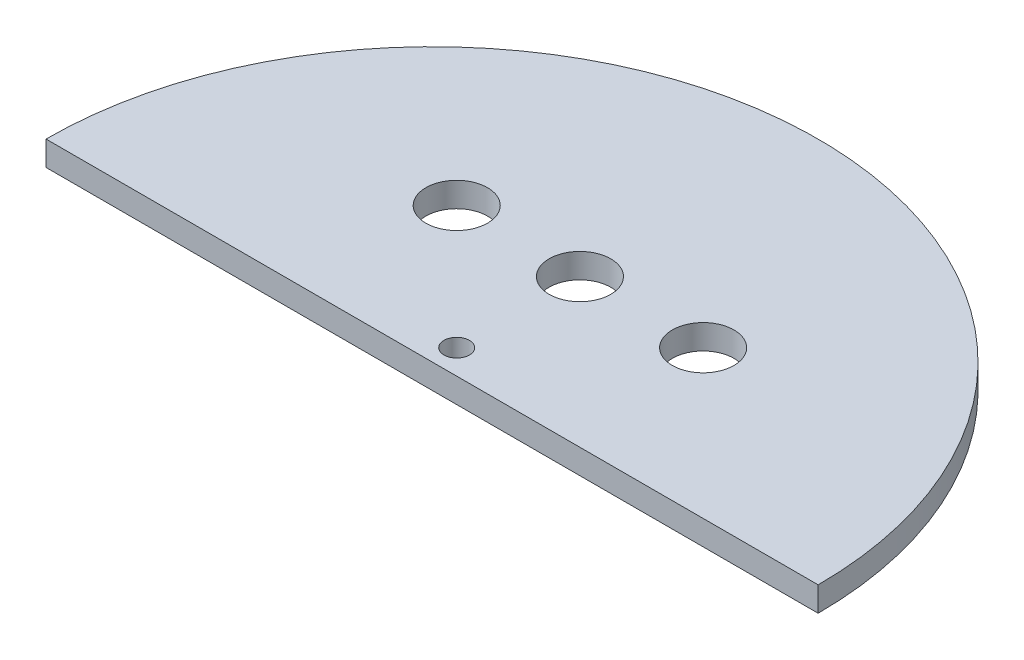
ISO-10303-21;
HEADER;
FILE_DESCRIPTION(('STEP AP214'),'2;1');
FILE_NAME('part.step','',(''),(''),'','','');
FILE_SCHEMA(('AUTOMOTIVE_DESIGN { 1 0 10303 214 1 1 1 1 }'));
ENDSEC;
DATA;
#1=APPLICATION_CONTEXT('core data for automotive mechanical design processes');
#2=APPLICATION_PROTOCOL_DEFINITION('international standard','automotive_design',2000,#1);
#3=PRODUCT_CONTEXT('',#1,'mechanical');
#4=PRODUCT('Part','Part','',(#3));
#5=PRODUCT_RELATED_PRODUCT_CATEGORY('part','',(#4));
#6=PRODUCT_DEFINITION_FORMATION('','',#4);
#7=PRODUCT_DEFINITION_CONTEXT('part definition',#1,'design');
#8=PRODUCT_DEFINITION('design','',#6,#7);
#9=PRODUCT_DEFINITION_SHAPE('','',#8);
#10=(LENGTH_UNIT() NAMED_UNIT(*) SI_UNIT(.MILLI.,.METRE.));
#11=(NAMED_UNIT(*) PLANE_ANGLE_UNIT() SI_UNIT($,.RADIAN.));
#12=(NAMED_UNIT(*) SI_UNIT($,.STERADIAN.) SOLID_ANGLE_UNIT());
#13=UNCERTAINTY_MEASURE_WITH_UNIT(LENGTH_MEASURE(1.E-05),#10,'distance_accuracy_value','');
#14=(GEOMETRIC_REPRESENTATION_CONTEXT(3) GLOBAL_UNCERTAINTY_ASSIGNED_CONTEXT((#13)) GLOBAL_UNIT_ASSIGNED_CONTEXT((#10,
#11,#12)) REPRESENTATION_CONTEXT('',''));
#15=CARTESIAN_POINT('',(0.,0.,0.));
#16=DIRECTION('',(0.,0.,1.));
#17=DIRECTION('',(1.,0.,0.));
#18=AXIS2_PLACEMENT_3D('',#15,#16,#17);
#19=CARTESIAN_POINT('',(47.,3.,0.));
#20=DIRECTION('',(0.,-1.,0.));
#21=DIRECTION('',(0.,0.,-1.));
#22=AXIS2_PLACEMENT_3D('',#19,#20,#21);
#23=PLANE('',#22);
#24=CARTESIAN_POINT('',(62.,3.,-18.));
#25=DIRECTION('',(0.,1.,0.));
#26=DIRECTION('',(0.,0.,1.));
#27=AXIS2_PLACEMENT_3D('',#24,#25,#26);
#28=CIRCLE('',#27,3.75000000000001);
#29=CARTESIAN_POINT('',(62.,3.,-14.25));
#30=VERTEX_POINT('',#29);
#31=EDGE_CURVE('E86',#30,#30,#28,.T.);
#32=ORIENTED_EDGE('',*,*,#31,.F.);
#33=EDGE_LOOP('',(#32));
#34=FACE_BOUND('',#33,.T.);
#35=CARTESIAN_POINT('',(32.,3.,-18.));
#36=DIRECTION('',(0.,1.,0.));
#37=DIRECTION('',(0.,0.,1.));
#38=AXIS2_PLACEMENT_3D('',#35,#36,#37);
#39=CIRCLE('',#38,3.75);
#40=CARTESIAN_POINT('',(32.,3.,-14.25));
#41=VERTEX_POINT('',#40);
#42=EDGE_CURVE('E92',#41,#41,#39,.T.);
#43=ORIENTED_EDGE('',*,*,#42,.F.);
#44=EDGE_LOOP('',(#43));
#45=FACE_BOUND('',#44,.T.);
#46=CARTESIAN_POINT('',(47.,3.,-18.));
#47=DIRECTION('',(0.,1.,0.));
#48=DIRECTION('',(0.,0.,1.));
#49=AXIS2_PLACEMENT_3D('',#46,#47,#48);
#50=CIRCLE('',#49,3.75);
#51=CARTESIAN_POINT('',(47.,3.,-14.25));
#52=VERTEX_POINT('',#51);
#53=EDGE_CURVE('E80',#52,#52,#50,.T.);
#54=ORIENTED_EDGE('',*,*,#53,.F.);
#55=EDGE_LOOP('',(#54));
#56=FACE_BOUND('',#55,.T.);
#57=CARTESIAN_POINT('',(47.,3.,0.));
#58=DIRECTION('',(0.,1.,0.));
#59=DIRECTION('',(0.,0.,-1.));
#60=AXIS2_PLACEMENT_3D('',#57,#58,#59);
#61=CIRCLE('',#60,47.);
#62=CARTESIAN_POINT('',(94.,3.,0.));
#63=VERTEX_POINT('',#62);
#64=CARTESIAN_POINT('',(0.,3.,0.));
#65=VERTEX_POINT('',#64);
#66=EDGE_CURVE('E63',#63,#65,#61,.T.);
#67=ORIENTED_EDGE('',*,*,#66,.T.);
#68=DIRECTION('',(1.,0.,0.));
#69=VECTOR('',#68,1.);
#70=CARTESIAN_POINT('',(0.,3.,0.));
#71=LINE('',#70,#69);
#72=EDGE_CURVE('E48',#65,#63,#71,.T.);
#73=ORIENTED_EDGE('',*,*,#72,.T.);
#74=EDGE_LOOP('',(#67,#73));
#75=FACE_BOUND('',#74,.T.);
#76=CARTESIAN_POINT('',(47.,3.,-3.));
#77=DIRECTION('',(0.,1.,0.));
#78=DIRECTION('',(0.,0.,1.));
#79=AXIS2_PLACEMENT_3D('',#76,#77,#78);
#80=CIRCLE('',#79,1.55);
#81=CARTESIAN_POINT('',(47.,3.,-1.45));
#82=VERTEX_POINT('',#81);
#83=EDGE_CURVE('E69',#82,#82,#80,.T.);
#84=ORIENTED_EDGE('',*,*,#83,.F.);
#85=EDGE_LOOP('',(#84));
#86=FACE_BOUND('',#85,.T.);
#87=ADVANCED_FACE('F32',(#34,#45,#56,#75,#86),#23,.F.);
#88=CARTESIAN_POINT('',(47.,0.,0.));
#89=DIRECTION('',(0.,-1.,0.));
#90=DIRECTION('',(0.,0.,-1.));
#91=AXIS2_PLACEMENT_3D('',#88,#89,#90);
#92=PLANE('',#91);
#93=CARTESIAN_POINT('',(62.,0.,-18.));
#94=DIRECTION('',(0.,1.,0.));
#95=DIRECTION('',(0.,0.,1.));
#96=AXIS2_PLACEMENT_3D('',#93,#94,#95);
#97=CIRCLE('',#96,3.75000000000001);
#98=CARTESIAN_POINT('',(62.,0.,-14.25));
#99=VERTEX_POINT('',#98);
#100=EDGE_CURVE('E89',#99,#99,#97,.T.);
#101=ORIENTED_EDGE('',*,*,#100,.T.);
#102=EDGE_LOOP('',(#101));
#103=FACE_BOUND('',#102,.T.);
#104=CARTESIAN_POINT('',(32.,0.,-18.));
#105=DIRECTION('',(0.,1.,0.));
#106=DIRECTION('',(0.,0.,1.));
#107=AXIS2_PLACEMENT_3D('',#104,#105,#106);
#108=CIRCLE('',#107,3.75);
#109=CARTESIAN_POINT('',(32.,0.,-14.25));
#110=VERTEX_POINT('',#109);
#111=EDGE_CURVE('E83',#110,#110,#108,.T.);
#112=ORIENTED_EDGE('',*,*,#111,.T.);
#113=EDGE_LOOP('',(#112));
#114=FACE_BOUND('',#113,.T.);
#115=CARTESIAN_POINT('',(47.,0.,-18.));
#116=DIRECTION('',(0.,1.,0.));
#117=DIRECTION('',(0.,0.,1.));
#118=AXIS2_PLACEMENT_3D('',#115,#116,#117);
#119=CIRCLE('',#118,3.75);
#120=CARTESIAN_POINT('',(47.,0.,-14.25));
#121=VERTEX_POINT('',#120);
#122=EDGE_CURVE('E78',#121,#121,#119,.T.);
#123=ORIENTED_EDGE('',*,*,#122,.T.);
#124=EDGE_LOOP('',(#123));
#125=FACE_BOUND('',#124,.T.);
#126=CARTESIAN_POINT('',(47.,0.,0.));
#127=DIRECTION('',(0.,1.,0.));
#128=DIRECTION('',(0.,0.,-1.));
#129=AXIS2_PLACEMENT_3D('',#126,#127,#128);
#130=CIRCLE('',#129,47.);
#131=CARTESIAN_POINT('',(94.,0.,0.));
#132=VERTEX_POINT('',#131);
#133=CARTESIAN_POINT('',(0.,0.,0.));
#134=VERTEX_POINT('',#133);
#135=EDGE_CURVE('E64',#132,#134,#130,.T.);
#136=ORIENTED_EDGE('',*,*,#135,.F.);
#137=DIRECTION('',(1.,0.,0.));
#138=VECTOR('',#137,1.);
#139=CARTESIAN_POINT('',(0.,0.,0.));
#140=LINE('',#139,#138);
#141=EDGE_CURVE('E56',#134,#132,#140,.T.);
#142=ORIENTED_EDGE('',*,*,#141,.F.);
#143=EDGE_LOOP('',(#136,#142));
#144=FACE_BOUND('',#143,.T.);
#145=CARTESIAN_POINT('',(47.,0.,-3.));
#146=DIRECTION('',(0.,1.,0.));
#147=DIRECTION('',(0.,0.,1.));
#148=AXIS2_PLACEMENT_3D('',#145,#146,#147);
#149=CIRCLE('',#148,1.55);
#150=CARTESIAN_POINT('',(47.,0.,-1.45));
#151=VERTEX_POINT('',#150);
#152=EDGE_CURVE('E72',#151,#151,#149,.T.);
#153=ORIENTED_EDGE('',*,*,#152,.T.);
#154=EDGE_LOOP('',(#153));
#155=FACE_BOUND('',#154,.T.);
#156=ADVANCED_FACE('F67',(#103,#114,#125,#144,#155),#92,.T.);
#157=CARTESIAN_POINT('',(47.,3.,0.));
#158=DIRECTION('',(0.,-1.,0.));
#159=DIRECTION('',(0.,0.,-1.));
#160=AXIS2_PLACEMENT_3D('',#157,#158,#159);
#161=CYLINDRICAL_SURFACE('',#160,47.);
#162=ORIENTED_EDGE('',*,*,#135,.T.);
#163=DIRECTION('',(0.,-1.,0.));
#164=VECTOR('',#163,1.);
#165=CARTESIAN_POINT('',(0.,3.,0.));
#166=LINE('',#165,#164);
#167=EDGE_CURVE('E11',#65,#134,#166,.T.);
#168=ORIENTED_EDGE('',*,*,#167,.F.);
#169=ORIENTED_EDGE('',*,*,#66,.F.);
#170=DIRECTION('',(0.,-1.,0.));
#171=VECTOR('',#170,1.);
#172=CARTESIAN_POINT('',(94.,3.,0.));
#173=LINE('',#172,#171);
#174=EDGE_CURVE('E41',#63,#132,#173,.T.);
#175=ORIENTED_EDGE('',*,*,#174,.T.);
#176=EDGE_LOOP('',(#162,#168,#169,#175));
#177=FACE_BOUND('',#176,.T.);
#178=ADVANCED_FACE('F34',(#177),#161,.T.);
#179=CARTESIAN_POINT('',(0.,3.,0.));
#180=DIRECTION('',(0.,0.,-1.));
#181=DIRECTION('',(-1.,0.,0.));
#182=AXIS2_PLACEMENT_3D('',#179,#180,#181);
#183=PLANE('',#182);
#184=ORIENTED_EDGE('',*,*,#141,.T.);
#185=ORIENTED_EDGE('',*,*,#174,.F.);
#186=ORIENTED_EDGE('',*,*,#72,.F.);
#187=ORIENTED_EDGE('',*,*,#167,.T.);
#188=EDGE_LOOP('',(#184,#185,#186,#187));
#189=FACE_BOUND('',#188,.T.);
#190=ADVANCED_FACE('F59',(#189),#183,.F.);
#191=CARTESIAN_POINT('',(47.,3.,-3.));
#192=DIRECTION('',(0.,-1.,0.));
#193=DIRECTION('',(0.,0.,-1.));
#194=AXIS2_PLACEMENT_3D('',#191,#192,#193);
#195=CYLINDRICAL_SURFACE('',#194,1.55);
#196=ORIENTED_EDGE('',*,*,#83,.T.);
#197=EDGE_LOOP('',(#196));
#198=FACE_BOUND('',#197,.T.);
#199=ORIENTED_EDGE('',*,*,#152,.F.);
#200=EDGE_LOOP('',(#199));
#201=FACE_BOUND('',#200,.T.);
#202=ADVANCED_FACE('F116',(#198,#201),#195,.F.);
#203=CARTESIAN_POINT('',(47.,0.,-18.));
#204=DIRECTION('',(0.,1.,0.));
#205=DIRECTION('',(0.,0.,1.));
#206=AXIS2_PLACEMENT_3D('',#203,#204,#205);
#207=CYLINDRICAL_SURFACE('',#206,3.75);
#208=ORIENTED_EDGE('',*,*,#122,.F.);
#209=EDGE_LOOP('',(#208));
#210=FACE_BOUND('',#209,.T.);
#211=ORIENTED_EDGE('',*,*,#53,.T.);
#212=EDGE_LOOP('',(#211));
#213=FACE_BOUND('',#212,.T.);
#214=ADVANCED_FACE('F104',(#210,#213),#207,.F.);
#215=CARTESIAN_POINT('',(32.,0.,-18.));
#216=DIRECTION('',(0.,1.,0.));
#217=DIRECTION('',(0.,0.,1.));
#218=AXIS2_PLACEMENT_3D('',#215,#216,#217);
#219=CYLINDRICAL_SURFACE('',#218,3.75);
#220=ORIENTED_EDGE('',*,*,#111,.F.);
#221=EDGE_LOOP('',(#220));
#222=FACE_BOUND('',#221,.T.);
#223=ORIENTED_EDGE('',*,*,#42,.T.);
#224=EDGE_LOOP('',(#223));
#225=FACE_BOUND('',#224,.T.);
#226=ADVANCED_FACE('F100',(#222,#225),#219,.F.);
#227=CARTESIAN_POINT('',(62.,0.,-18.));
#228=DIRECTION('',(0.,1.,0.));
#229=DIRECTION('',(0.,0.,1.));
#230=AXIS2_PLACEMENT_3D('',#227,#228,#229);
#231=CYLINDRICAL_SURFACE('',#230,3.75000000000001);
#232=ORIENTED_EDGE('',*,*,#100,.F.);
#233=EDGE_LOOP('',(#232));
#234=FACE_BOUND('',#233,.T.);
#235=ORIENTED_EDGE('',*,*,#31,.T.);
#236=EDGE_LOOP('',(#235));
#237=FACE_BOUND('',#236,.T.);
#238=ADVANCED_FACE('F103',(#234,#237),#231,.F.);
#239=CLOSED_SHELL('',(#87,#156,#178,#190,#202,#214,#226,#238));
#240=MANIFOLD_SOLID_BREP('B2',#239);
#241=ADVANCED_BREP_SHAPE_REPRESENTATION('',(#18,#240),#14);
#242=SHAPE_DEFINITION_REPRESENTATION(#9,#241);
ENDSEC;
END-ISO-10303-21;
